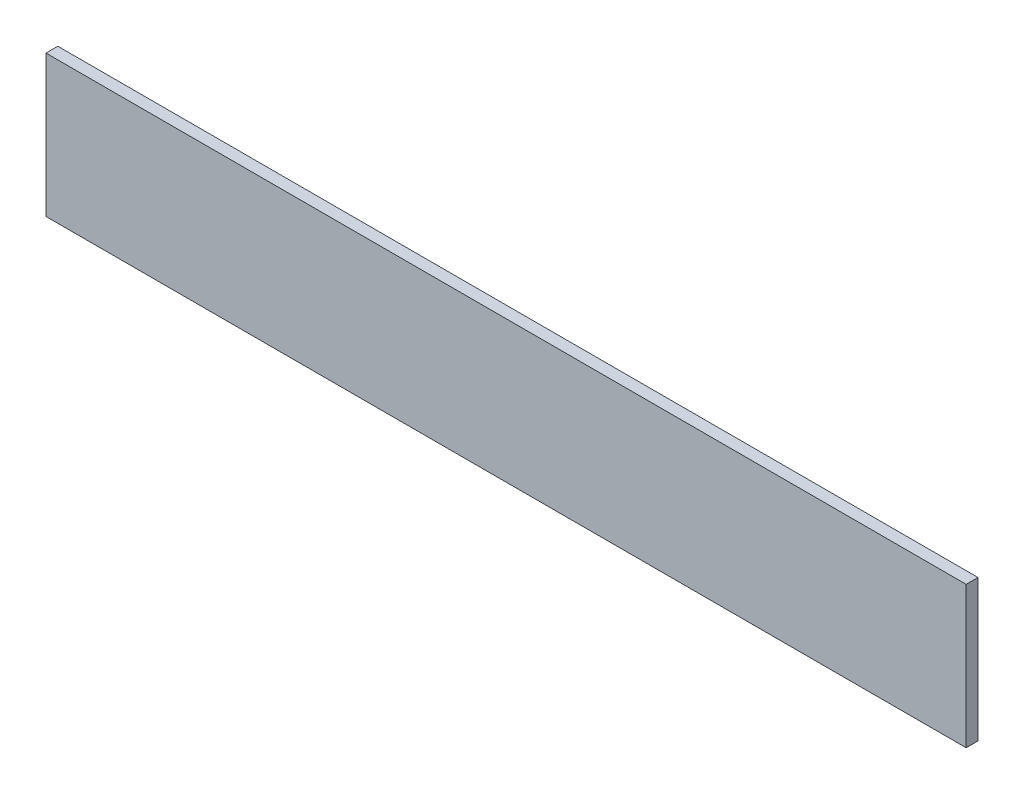
ISO-10303-21;
HEADER;
FILE_DESCRIPTION(('STEP AP214'),'2;1');
FILE_NAME('part.step','',(''),(''),'','','');
FILE_SCHEMA(('AUTOMOTIVE_DESIGN { 1 0 10303 214 1 1 1 1 }'));
ENDSEC;
DATA;
#1=APPLICATION_CONTEXT('core data for automotive mechanical design processes');
#2=APPLICATION_PROTOCOL_DEFINITION('international standard','automotive_design',2000,#1);
#3=PRODUCT_CONTEXT('',#1,'mechanical');
#4=PRODUCT('Part','Part','',(#3));
#5=PRODUCT_RELATED_PRODUCT_CATEGORY('part','',(#4));
#6=PRODUCT_DEFINITION_FORMATION('','',#4);
#7=PRODUCT_DEFINITION_CONTEXT('part definition',#1,'design');
#8=PRODUCT_DEFINITION('design','',#6,#7);
#9=PRODUCT_DEFINITION_SHAPE('','',#8);
#10=(LENGTH_UNIT() NAMED_UNIT(*) SI_UNIT(.MILLI.,.METRE.));
#11=(NAMED_UNIT(*) PLANE_ANGLE_UNIT() SI_UNIT($,.RADIAN.));
#12=(NAMED_UNIT(*) SI_UNIT($,.STERADIAN.) SOLID_ANGLE_UNIT());
#13=UNCERTAINTY_MEASURE_WITH_UNIT(LENGTH_MEASURE(1.E-05),#10,'distance_accuracy_value','');
#14=(GEOMETRIC_REPRESENTATION_CONTEXT(3) GLOBAL_UNCERTAINTY_ASSIGNED_CONTEXT((#13)) GLOBAL_UNIT_ASSIGNED_CONTEXT((#10,
#11,#12)) REPRESENTATION_CONTEXT('',''));
#15=CARTESIAN_POINT('',(0.,0.,0.));
#16=DIRECTION('',(0.,0.,1.));
#17=DIRECTION('',(1.,0.,0.));
#18=AXIS2_PLACEMENT_3D('',#15,#16,#17);
#19=CARTESIAN_POINT('',(1.1594589413635,1.4190983628665,1.7496000059366));
#20=DIRECTION('',(0.,1.,0.));
#21=DIRECTION('',(0.,0.,1.));
#22=AXIS2_PLACEMENT_3D('',#19,#20,#21);
#23=PLANE('',#22);
#24=DIRECTION('',(0.,0.,1.));
#25=VECTOR('',#24,1.);
#26=CARTESIAN_POINT('',(1.1439141430621,1.4190983628665,1.7492000059366));
#27=LINE('',#26,#25);
#28=CARTESIAN_POINT('',(1.1439141430621,1.4190983628665,1.7492000059366));
#29=VERTEX_POINT('',#28);
#30=CARTESIAN_POINT('',(1.1439141430621,1.4190983628665,1.7496000059366));
#31=VERTEX_POINT('',#30);
#32=EDGE_CURVE('E11',#29,#31,#27,.T.);
#33=ORIENTED_EDGE('',*,*,#32,.T.);
#34=DIRECTION('',(1.,0.,0.));
#35=VECTOR('',#34,1.);
#36=CARTESIAN_POINT('',(1.1439141430621,1.4190983628665,1.7496000059366));
#37=LINE('',#36,#35);
#38=CARTESIAN_POINT('',(1.1750037396649,1.4190983628665,1.7496000059366));
#39=VERTEX_POINT('',#38);
#40=EDGE_CURVE('E24',#31,#39,#37,.T.);
#41=ORIENTED_EDGE('',*,*,#40,.T.);
#42=DIRECTION('',(0.,0.,1.));
#43=VECTOR('',#42,1.);
#44=CARTESIAN_POINT('',(1.1750037396649,1.4190983628665,1.7492000059366));
#45=LINE('',#44,#43);
#46=CARTESIAN_POINT('',(1.1750037396649,1.4190983628665,1.7492000059366));
#47=VERTEX_POINT('',#46);
#48=EDGE_CURVE('E85',#47,#39,#45,.T.);
#49=ORIENTED_EDGE('',*,*,#48,.F.);
#50=DIRECTION('',(1.,0.,0.));
#51=VECTOR('',#50,1.);
#52=CARTESIAN_POINT('',(1.1439141430621,1.4190983628665,1.7492000059366));
#53=LINE('',#52,#51);
#54=EDGE_CURVE('E83',#29,#47,#53,.T.);
#55=ORIENTED_EDGE('',*,*,#54,.F.);
#56=EDGE_LOOP('',(#33,#41,#49,#55));
#57=FACE_BOUND('',#56,.T.);
#58=ADVANCED_FACE('F17',(#57),#23,.T.);
#59=CARTESIAN_POINT('',(1.1750037396649,1.4167068554355,1.7496000059366));
#60=DIRECTION('',(1.,0.,0.));
#61=DIRECTION('',(0.,0.,-1.));
#62=AXIS2_PLACEMENT_3D('',#59,#60,#61);
#63=PLANE('',#62);
#64=ORIENTED_EDGE('',*,*,#48,.T.);
#65=DIRECTION('',(0.,-1.,0.));
#66=VECTOR('',#65,1.);
#67=CARTESIAN_POINT('',(1.1750037396649,1.4190983628665,1.7496000059366));
#68=LINE('',#67,#66);
#69=CARTESIAN_POINT('',(1.1750037396649,1.4143153480045,1.7496000059366));
#70=VERTEX_POINT('',#69);
#71=EDGE_CURVE('E81',#39,#70,#68,.T.);
#72=ORIENTED_EDGE('',*,*,#71,.T.);
#73=DIRECTION('',(0.,0.,1.));
#74=VECTOR('',#73,1.);
#75=CARTESIAN_POINT('',(1.1750037396649,1.4143153480045,1.7492000059366));
#76=LINE('',#75,#74);
#77=CARTESIAN_POINT('',(1.1750037396649,1.4143153480045,1.7492000059366));
#78=VERTEX_POINT('',#77);
#79=EDGE_CURVE('E79',#78,#70,#76,.T.);
#80=ORIENTED_EDGE('',*,*,#79,.F.);
#81=DIRECTION('',(0.,-1.,0.));
#82=VECTOR('',#81,1.);
#83=CARTESIAN_POINT('',(1.1750037396649,1.4190983628665,1.7492000059366));
#84=LINE('',#83,#82);
#85=EDGE_CURVE('E70',#47,#78,#84,.T.);
#86=ORIENTED_EDGE('',*,*,#85,.F.);
#87=EDGE_LOOP('',(#64,#72,#80,#86));
#88=FACE_BOUND('',#87,.T.);
#89=ADVANCED_FACE('F90',(#88),#63,.T.);
#90=CARTESIAN_POINT('',(1.1594589413635,1.4143153480045,1.7496000059366));
#91=DIRECTION('',(0.,-1.,0.));
#92=DIRECTION('',(0.,0.,-1.));
#93=AXIS2_PLACEMENT_3D('',#90,#91,#92);
#94=PLANE('',#93);
#95=ORIENTED_EDGE('',*,*,#79,.T.);
#96=DIRECTION('',(-1.,0.,0.));
#97=VECTOR('',#96,1.);
#98=CARTESIAN_POINT('',(1.1750037396649,1.4143153480045,1.7496000059366));
#99=LINE('',#98,#97);
#100=CARTESIAN_POINT('',(1.1439141430621,1.4143153480045,1.7496000059366));
#101=VERTEX_POINT('',#100);
#102=EDGE_CURVE('E60',#70,#101,#99,.T.);
#103=ORIENTED_EDGE('',*,*,#102,.T.);
#104=DIRECTION('',(0.,0.,1.));
#105=VECTOR('',#104,1.);
#106=CARTESIAN_POINT('',(1.1439141430621,1.4143153480045,1.7492000059366));
#107=LINE('',#106,#105);
#108=CARTESIAN_POINT('',(1.1439141430621,1.4143153480045,1.7492000059366));
#109=VERTEX_POINT('',#108);
#110=EDGE_CURVE('E54',#109,#101,#107,.T.);
#111=ORIENTED_EDGE('',*,*,#110,.F.);
#112=DIRECTION('',(-1.,0.,0.));
#113=VECTOR('',#112,1.);
#114=CARTESIAN_POINT('',(1.1750037396649,1.4143153480045,1.7492000059366));
#115=LINE('',#114,#113);
#116=EDGE_CURVE('E58',#78,#109,#115,.T.);
#117=ORIENTED_EDGE('',*,*,#116,.F.);
#118=EDGE_LOOP('',(#95,#103,#111,#117));
#119=FACE_BOUND('',#118,.T.);
#120=ADVANCED_FACE('F57',(#119),#94,.T.);
#121=CARTESIAN_POINT('',(1.1439141430621,1.4167068554355,1.7496000059366));
#122=DIRECTION('',(-1.,0.,0.));
#123=DIRECTION('',(0.,0.,1.));
#124=AXIS2_PLACEMENT_3D('',#121,#122,#123);
#125=PLANE('',#124);
#126=ORIENTED_EDGE('',*,*,#110,.T.);
#127=DIRECTION('',(0.,1.,0.));
#128=VECTOR('',#127,1.);
#129=CARTESIAN_POINT('',(1.1439141430621,1.4143153480045,1.7496000059366));
#130=LINE('',#129,#128);
#131=EDGE_CURVE('E71',#101,#31,#130,.T.);
#132=ORIENTED_EDGE('',*,*,#131,.T.);
#133=ORIENTED_EDGE('',*,*,#32,.F.);
#134=DIRECTION('',(0.,1.,0.));
#135=VECTOR('',#134,1.);
#136=CARTESIAN_POINT('',(1.1439141430621,1.4143153480045,1.7492000059366));
#137=LINE('',#136,#135);
#138=EDGE_CURVE('E68',#109,#29,#137,.T.);
#139=ORIENTED_EDGE('',*,*,#138,.F.);
#140=EDGE_LOOP('',(#126,#132,#133,#139));
#141=FACE_BOUND('',#140,.T.);
#142=ADVANCED_FACE('F73',(#141),#125,.T.);
#143=CARTESIAN_POINT('',(1.1439141430621,1.4167068554355,1.7492000059366));
#144=DIRECTION('',(0.,0.,-1.));
#145=DIRECTION('',(-1.,0.,0.));
#146=AXIS2_PLACEMENT_3D('',#143,#144,#145);
#147=PLANE('',#146);
#148=ORIENTED_EDGE('',*,*,#54,.T.);
#149=ORIENTED_EDGE('',*,*,#85,.T.);
#150=ORIENTED_EDGE('',*,*,#116,.T.);
#151=ORIENTED_EDGE('',*,*,#138,.T.);
#152=EDGE_LOOP('',(#148,#149,#150,#151));
#153=FACE_BOUND('',#152,.T.);
#154=ADVANCED_FACE('F67',(#153),#147,.T.);
#155=CARTESIAN_POINT('',(1.1439141430621,1.4167068554355,1.7496000059366));
#156=DIRECTION('',(0.,0.,-1.));
#157=DIRECTION('',(-1.,0.,0.));
#158=AXIS2_PLACEMENT_3D('',#155,#156,#157);
#159=PLANE('',#158);
#160=ORIENTED_EDGE('',*,*,#40,.F.);
#161=ORIENTED_EDGE('',*,*,#131,.F.);
#162=ORIENTED_EDGE('',*,*,#102,.F.);
#163=ORIENTED_EDGE('',*,*,#71,.F.);
#164=EDGE_LOOP('',(#160,#161,#162,#163));
#165=FACE_BOUND('',#164,.T.);
#166=ADVANCED_FACE('F91',(#165),#159,.F.);
#167=CLOSED_SHELL('',(#58,#89,#120,#142,#154,#166));
#168=MANIFOLD_SOLID_BREP('B1',#167);
#169=ADVANCED_BREP_SHAPE_REPRESENTATION('',(#18,#168),#14);
#170=SHAPE_DEFINITION_REPRESENTATION(#9,#169);
ENDSEC;
END-ISO-10303-21;
